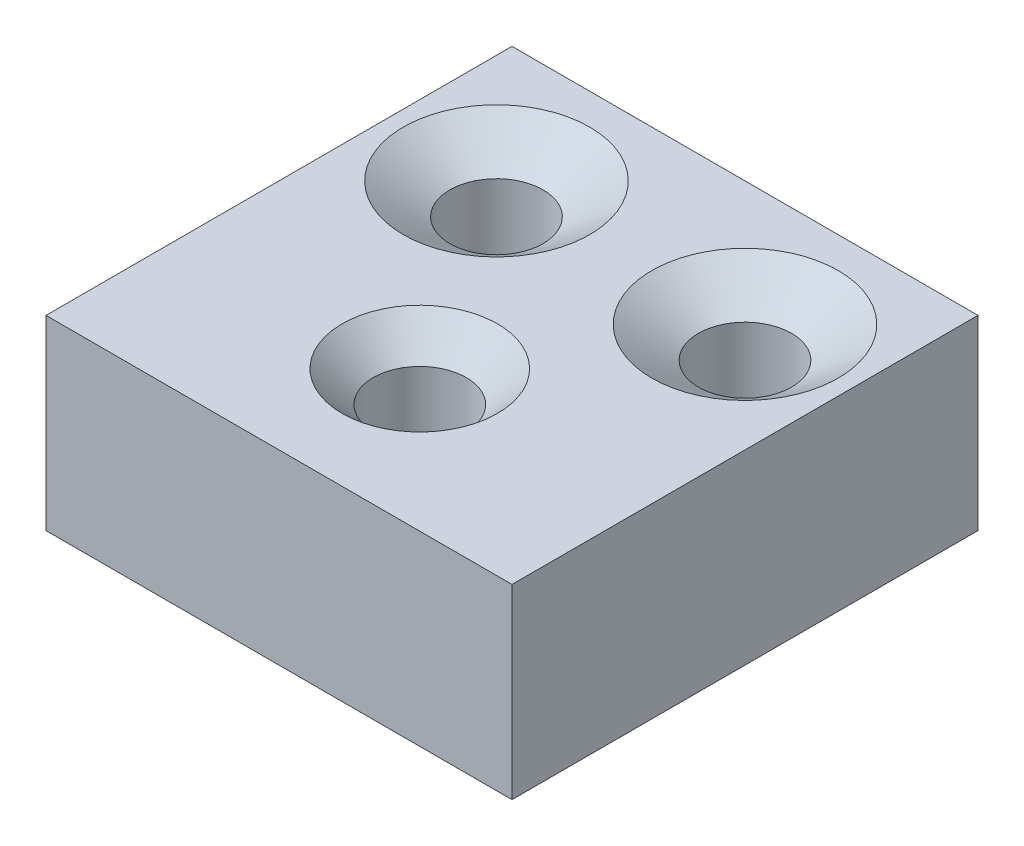
ISO-10303-21;
HEADER;
FILE_DESCRIPTION(('STEP AP214'),'2;1');
FILE_NAME('part.step','',(''),(''),'','','');
FILE_SCHEMA(('AUTOMOTIVE_DESIGN { 1 0 10303 214 1 1 1 1 }'));
ENDSEC;
DATA;
#1=APPLICATION_CONTEXT('core data for automotive mechanical design processes');
#2=APPLICATION_PROTOCOL_DEFINITION('international standard','automotive_design',2000,#1);
#3=PRODUCT_CONTEXT('',#1,'mechanical');
#4=PRODUCT('Part','Part','',(#3));
#5=PRODUCT_RELATED_PRODUCT_CATEGORY('part','',(#4));
#6=PRODUCT_DEFINITION_FORMATION('','',#4);
#7=PRODUCT_DEFINITION_CONTEXT('part definition',#1,'design');
#8=PRODUCT_DEFINITION('design','',#6,#7);
#9=PRODUCT_DEFINITION_SHAPE('','',#8);
#10=(LENGTH_UNIT() NAMED_UNIT(*) SI_UNIT(.MILLI.,.METRE.));
#11=(NAMED_UNIT(*) PLANE_ANGLE_UNIT() SI_UNIT($,.RADIAN.));
#12=(NAMED_UNIT(*) SI_UNIT($,.STERADIAN.) SOLID_ANGLE_UNIT());
#13=UNCERTAINTY_MEASURE_WITH_UNIT(LENGTH_MEASURE(1.E-05),#10,'distance_accuracy_value','');
#14=(GEOMETRIC_REPRESENTATION_CONTEXT(3) GLOBAL_UNCERTAINTY_ASSIGNED_CONTEXT((#13)) GLOBAL_UNIT_ASSIGNED_CONTEXT((#10,
#11,#12)) REPRESENTATION_CONTEXT('',''));
#15=CARTESIAN_POINT('',(0.,0.,0.));
#16=DIRECTION('',(0.,0.,1.));
#17=DIRECTION('',(1.,0.,0.));
#18=AXIS2_PLACEMENT_3D('',#15,#16,#17);
#19=CARTESIAN_POINT('',(75.,60.,40.));
#20=DIRECTION('',(-1.,0.,0.));
#21=DIRECTION('',(0.,0.,1.));
#22=AXIS2_PLACEMENT_3D('',#19,#20,#21);
#23=PLANE('',#22);
#24=DIRECTION('',(0.,0.,-1.));
#25=VECTOR('',#24,1.);
#26=CARTESIAN_POINT('',(75.,0.,40.));
#27=LINE('',#26,#25);
#28=CARTESIAN_POINT('',(75.,0.,110.));
#29=VERTEX_POINT('',#28);
#30=CARTESIAN_POINT('',(75.,0.,-40.));
#31=VERTEX_POINT('',#30);
#32=EDGE_CURVE('E87',#29,#31,#27,.T.);
#33=ORIENTED_EDGE('',*,*,#32,.T.);
#34=DIRECTION('',(0.,-1.,0.));
#35=VECTOR('',#34,1.);
#36=CARTESIAN_POINT('',(75.,60.,-40.));
#37=LINE('',#36,#35);
#38=CARTESIAN_POINT('',(75.,60.,-40.));
#39=VERTEX_POINT('',#38);
#40=EDGE_CURVE('E11',#39,#31,#37,.T.);
#41=ORIENTED_EDGE('',*,*,#40,.F.);
#42=DIRECTION('',(0.,0.,-1.));
#43=VECTOR('',#42,1.);
#44=CARTESIAN_POINT('',(75.,60.,40.));
#45=LINE('',#44,#43);
#46=CARTESIAN_POINT('',(75.,60.,110.));
#47=VERTEX_POINT('',#46);
#48=EDGE_CURVE('E81',#47,#39,#45,.T.);
#49=ORIENTED_EDGE('',*,*,#48,.F.);
#50=DIRECTION('',(0.,1.,0.));
#51=VECTOR('',#50,1.);
#52=CARTESIAN_POINT('',(75.,60.,110.));
#53=LINE('',#52,#51);
#54=EDGE_CURVE('E91',#29,#47,#53,.T.);
#55=ORIENTED_EDGE('',*,*,#54,.F.);
#56=EDGE_LOOP('',(#33,#41,#49,#55));
#57=FACE_BOUND('',#56,.T.);
#58=ADVANCED_FACE('F33',(#57),#23,.F.);
#59=CARTESIAN_POINT('',(-75.,60.,-40.));
#60=DIRECTION('',(0.,0.,1.));
#61=DIRECTION('',(1.,0.,0.));
#62=AXIS2_PLACEMENT_3D('',#59,#60,#61);
#63=PLANE('',#62);
#64=DIRECTION('',(-1.,0.,0.));
#65=VECTOR('',#64,1.);
#66=CARTESIAN_POINT('',(-75.,0.,-40.));
#67=LINE('',#66,#65);
#68=CARTESIAN_POINT('',(-75.,0.,-40.));
#69=VERTEX_POINT('',#68);
#70=EDGE_CURVE('E60',#31,#69,#67,.T.);
#71=ORIENTED_EDGE('',*,*,#70,.T.);
#72=DIRECTION('',(0.,-1.,0.));
#73=VECTOR('',#72,1.);
#74=CARTESIAN_POINT('',(-75.,60.,-40.));
#75=LINE('',#74,#73);
#76=CARTESIAN_POINT('',(-75.,60.,-40.));
#77=VERTEX_POINT('',#76);
#78=EDGE_CURVE('E41',#77,#69,#75,.T.);
#79=ORIENTED_EDGE('',*,*,#78,.F.);
#80=DIRECTION('',(-1.,0.,0.));
#81=VECTOR('',#80,1.);
#82=CARTESIAN_POINT('',(-75.,60.,-40.));
#83=LINE('',#82,#81);
#84=EDGE_CURVE('E49',#39,#77,#83,.T.);
#85=ORIENTED_EDGE('',*,*,#84,.F.);
#86=ORIENTED_EDGE('',*,*,#40,.T.);
#87=EDGE_LOOP('',(#71,#79,#85,#86));
#88=FACE_BOUND('',#87,.T.);
#89=ADVANCED_FACE('F127',(#88),#63,.F.);
#90=CARTESIAN_POINT('',(-75.,60.,40.));
#91=DIRECTION('',(1.,0.,0.));
#92=DIRECTION('',(0.,0.,-1.));
#93=AXIS2_PLACEMENT_3D('',#90,#91,#92);
#94=PLANE('',#93);
#95=DIRECTION('',(0.,0.,1.));
#96=VECTOR('',#95,1.);
#97=CARTESIAN_POINT('',(-75.,0.,40.));
#98=LINE('',#97,#96);
#99=CARTESIAN_POINT('',(-75.,0.,110.));
#100=VERTEX_POINT('',#99);
#101=EDGE_CURVE('E76',#69,#100,#98,.T.);
#102=ORIENTED_EDGE('',*,*,#101,.T.);
#103=DIRECTION('',(0.,-1.,0.));
#104=VECTOR('',#103,1.);
#105=CARTESIAN_POINT('',(-75.,60.,110.));
#106=LINE('',#105,#104);
#107=CARTESIAN_POINT('',(-75.,60.,110.));
#108=VERTEX_POINT('',#107);
#109=EDGE_CURVE('E80',#108,#100,#106,.T.);
#110=ORIENTED_EDGE('',*,*,#109,.F.);
#111=DIRECTION('',(0.,0.,1.));
#112=VECTOR('',#111,1.);
#113=CARTESIAN_POINT('',(-75.,60.,40.));
#114=LINE('',#113,#112);
#115=EDGE_CURVE('E64',#77,#108,#114,.T.);
#116=ORIENTED_EDGE('',*,*,#115,.F.);
#117=ORIENTED_EDGE('',*,*,#78,.T.);
#118=EDGE_LOOP('',(#102,#110,#116,#117));
#119=FACE_BOUND('',#118,.T.);
#120=ADVANCED_FACE('F78',(#119),#94,.F.);
#121=CARTESIAN_POINT('',(0.,60.,0.));
#122=DIRECTION('',(0.,-1.,0.));
#123=DIRECTION('',(0.,0.,-1.));
#124=AXIS2_PLACEMENT_3D('',#121,#122,#123);
#125=PLANE('',#124);
#126=CARTESIAN_POINT('',(0.,60.,64.6788910412876));
#127=DIRECTION('',(0.,1.,0.));
#128=DIRECTION('',(0.,0.,1.));
#129=AXIS2_PLACEMENT_3D('',#126,#127,#128);
#130=CIRCLE('',#129,25.);
#131=CARTESIAN_POINT('',(0.,60.,89.6788910412876));
#132=VERTEX_POINT('',#131);
#133=EDGE_CURVE('E266',#132,#132,#130,.T.);
#134=ORIENTED_EDGE('',*,*,#133,.F.);
#135=EDGE_LOOP('',(#134));
#136=FACE_BOUND('',#135,.T.);
#137=CARTESIAN_POINT('',(40.,60.,0.));
#138=DIRECTION('',(0.,1.,0.));
#139=DIRECTION('',(0.,0.,-1.));
#140=AXIS2_PLACEMENT_3D('',#137,#138,#139);
#141=CIRCLE('',#140,30.);
#142=CARTESIAN_POINT('',(40.,60.,-30.));
#143=VERTEX_POINT('',#142);
#144=EDGE_CURVE('E110',#143,#143,#141,.T.);
#145=ORIENTED_EDGE('',*,*,#144,.F.);
#146=EDGE_LOOP('',(#145));
#147=FACE_BOUND('',#146,.T.);
#148=CARTESIAN_POINT('',(-40.,60.,0.));
#149=DIRECTION('',(0.,-1.,0.));
#150=DIRECTION('',(0.,0.,-1.));
#151=AXIS2_PLACEMENT_3D('',#148,#149,#150);
#152=CIRCLE('',#151,30.);
#153=CARTESIAN_POINT('',(-40.,60.,-30.));
#154=VERTEX_POINT('',#153);
#155=EDGE_CURVE('E119',#154,#154,#152,.T.);
#156=ORIENTED_EDGE('',*,*,#155,.T.);
#157=EDGE_LOOP('',(#156));
#158=FACE_BOUND('',#157,.T.);
#159=ORIENTED_EDGE('',*,*,#48,.T.);
#160=ORIENTED_EDGE('',*,*,#84,.T.);
#161=ORIENTED_EDGE('',*,*,#115,.T.);
#162=DIRECTION('',(-1.,0.,0.));
#163=VECTOR('',#162,1.);
#164=CARTESIAN_POINT('',(-75.,60.,110.));
#165=LINE('',#164,#163);
#166=EDGE_CURVE('E94',#47,#108,#165,.T.);
#167=ORIENTED_EDGE('',*,*,#166,.F.);
#168=EDGE_LOOP('',(#159,#160,#161,#167));
#169=FACE_BOUND('',#168,.T.);
#170=ADVANCED_FACE('F130',(#136,#147,#158,#169),#125,.F.);
#171=CARTESIAN_POINT('',(0.,0.,0.));
#172=DIRECTION('',(0.,-1.,0.));
#173=DIRECTION('',(0.,0.,-1.));
#174=AXIS2_PLACEMENT_3D('',#171,#172,#173);
#175=PLANE('',#174);
#176=ORIENTED_EDGE('',*,*,#32,.F.);
#177=DIRECTION('',(1.,0.,0.));
#178=VECTOR('',#177,1.);
#179=CARTESIAN_POINT('',(-75.,0.,110.));
#180=LINE('',#179,#178);
#181=EDGE_CURVE('E84',#100,#29,#180,.T.);
#182=ORIENTED_EDGE('',*,*,#181,.F.);
#183=ORIENTED_EDGE('',*,*,#101,.F.);
#184=ORIENTED_EDGE('',*,*,#70,.F.);
#185=EDGE_LOOP('',(#176,#182,#183,#184));
#186=FACE_BOUND('',#185,.T.);
#187=ADVANCED_FACE('F85',(#186),#175,.T.);
#188=CARTESIAN_POINT('',(-40.,60.,0.));
#189=DIRECTION('',(0.,1.,0.));
#190=DIRECTION('',(0.,0.,1.));
#191=AXIS2_PLACEMENT_3D('',#188,#189,#190);
#192=CONICAL_SURFACE('',#191,30.,0.98279372324733);
#193=CARTESIAN_POINT('',(-40.,50.,0.));
#194=DIRECTION('',(0.,-1.,0.));
#195=DIRECTION('',(0.,0.,-1.));
#196=AXIS2_PLACEMENT_3D('',#193,#194,#195);
#197=CIRCLE('',#196,15.);
#198=CARTESIAN_POINT('',(-40.,50.,-15.));
#199=VERTEX_POINT('',#198);
#200=EDGE_CURVE('E116',#199,#199,#197,.T.);
#201=ORIENTED_EDGE('',*,*,#200,.T.);
#202=EDGE_LOOP('',(#201));
#203=FACE_BOUND('',#202,.T.);
#204=ORIENTED_EDGE('',*,*,#155,.F.);
#205=EDGE_LOOP('',(#204));
#206=FACE_BOUND('',#205,.T.);
#207=ADVANCED_FACE('F138',(#203,#206),#192,.F.);
#208=CARTESIAN_POINT('',(-40.,9.99999999999999,0.));
#209=DIRECTION('',(0.,-1.,0.));
#210=DIRECTION('',(0.,0.,-1.));
#211=AXIS2_PLACEMENT_3D('',#208,#209,#210);
#212=CYLINDRICAL_SURFACE('',#211,15.);
#213=CARTESIAN_POINT('',(-40.,9.99999999999999,0.));
#214=DIRECTION('',(0.,-1.,0.));
#215=DIRECTION('',(0.,0.,-1.));
#216=AXIS2_PLACEMENT_3D('',#213,#214,#215);
#217=CIRCLE('',#216,15.);
#218=CARTESIAN_POINT('',(-40.,9.99999999999999,-15.));
#219=VERTEX_POINT('',#218);
#220=EDGE_CURVE('E113',#219,#219,#217,.T.);
#221=ORIENTED_EDGE('',*,*,#220,.T.);
#222=EDGE_LOOP('',(#221));
#223=FACE_BOUND('',#222,.T.);
#224=ORIENTED_EDGE('',*,*,#200,.F.);
#225=EDGE_LOOP('',(#224));
#226=FACE_BOUND('',#225,.T.);
#227=ADVANCED_FACE('F157',(#223,#226),#212,.F.);
#228=CARTESIAN_POINT('',(-55.,9.99999999999999,0.));
#229=DIRECTION('',(0.,1.,0.));
#230=DIRECTION('',(0.,0.,1.));
#231=AXIS2_PLACEMENT_3D('',#228,#229,#230);
#232=PLANE('',#231);
#233=ORIENTED_EDGE('',*,*,#220,.F.);
#234=EDGE_LOOP('',(#233));
#235=FACE_BOUND('',#234,.T.);
#236=ADVANCED_FACE('F164',(#235),#232,.T.);
#237=CARTESIAN_POINT('',(40.,60.,0.));
#238=DIRECTION('',(0.,1.,0.));
#239=DIRECTION('',(0.,0.,1.));
#240=AXIS2_PLACEMENT_3D('',#237,#238,#239);
#241=CONICAL_SURFACE('',#240,30.,0.98279372324733);
#242=CARTESIAN_POINT('',(40.,50.,0.));
#243=DIRECTION('',(0.,1.,0.));
#244=DIRECTION('',(0.,0.,-1.));
#245=AXIS2_PLACEMENT_3D('',#242,#243,#244);
#246=CIRCLE('',#245,15.);
#247=CARTESIAN_POINT('',(40.,50.,-15.));
#248=VERTEX_POINT('',#247);
#249=EDGE_CURVE('E107',#248,#248,#246,.T.);
#250=ORIENTED_EDGE('',*,*,#249,.F.);
#251=EDGE_LOOP('',(#250));
#252=FACE_BOUND('',#251,.T.);
#253=ORIENTED_EDGE('',*,*,#144,.T.);
#254=EDGE_LOOP('',(#253));
#255=FACE_BOUND('',#254,.T.);
#256=ADVANCED_FACE('F172',(#252,#255),#241,.F.);
#257=CARTESIAN_POINT('',(40.,9.99999999999999,0.));
#258=DIRECTION('',(0.,-1.,0.));
#259=DIRECTION('',(0.,0.,-1.));
#260=AXIS2_PLACEMENT_3D('',#257,#258,#259);
#261=CYLINDRICAL_SURFACE('',#260,15.);
#262=CARTESIAN_POINT('',(40.,9.99999999999999,0.));
#263=DIRECTION('',(0.,1.,0.));
#264=DIRECTION('',(0.,0.,-1.));
#265=AXIS2_PLACEMENT_3D('',#262,#263,#264);
#266=CIRCLE('',#265,15.);
#267=CARTESIAN_POINT('',(40.,9.99999999999999,-15.));
#268=VERTEX_POINT('',#267);
#269=EDGE_CURVE('E104',#268,#268,#266,.T.);
#270=ORIENTED_EDGE('',*,*,#269,.F.);
#271=EDGE_LOOP('',(#270));
#272=FACE_BOUND('',#271,.T.);
#273=ORIENTED_EDGE('',*,*,#249,.T.);
#274=EDGE_LOOP('',(#273));
#275=FACE_BOUND('',#274,.T.);
#276=ADVANCED_FACE('F180',(#272,#275),#261,.F.);
#277=CARTESIAN_POINT('',(55.,9.99999999999999,0.));
#278=DIRECTION('',(0.,1.,0.));
#279=DIRECTION('',(0.,0.,1.));
#280=AXIS2_PLACEMENT_3D('',#277,#278,#279);
#281=PLANE('',#280);
#282=ORIENTED_EDGE('',*,*,#269,.T.);
#283=EDGE_LOOP('',(#282));
#284=FACE_BOUND('',#283,.T.);
#285=ADVANCED_FACE('F187',(#284),#281,.T.);
#286=CARTESIAN_POINT('',(0.,0.,110.));
#287=DIRECTION('',(0.,0.,1.));
#288=DIRECTION('',(1.,0.,0.));
#289=AXIS2_PLACEMENT_3D('',#286,#287,#288);
#290=PLANE('',#289);
#291=ORIENTED_EDGE('',*,*,#109,.T.);
#292=ORIENTED_EDGE('',*,*,#181,.T.);
#293=ORIENTED_EDGE('',*,*,#54,.T.);
#294=ORIENTED_EDGE('',*,*,#166,.T.);
#295=EDGE_LOOP('',(#291,#292,#293,#294));
#296=FACE_BOUND('',#295,.T.);
#297=ADVANCED_FACE('F93',(#296),#290,.T.);
#298=CARTESIAN_POINT('',(0.,9.99999999999999,64.6788910412876));
#299=DIRECTION('',(0.,-1.,0.));
#300=DIRECTION('',(0.,0.,-1.));
#301=AXIS2_PLACEMENT_3D('',#298,#299,#300);
#302=PLANE('',#301);
#303=CARTESIAN_POINT('',(0.,9.99999999999999,64.6788910412876));
#304=DIRECTION('',(0.,1.,0.));
#305=DIRECTION('',(0.,0.,1.));
#306=AXIS2_PLACEMENT_3D('',#303,#304,#305);
#307=CIRCLE('',#306,15.);
#308=CARTESIAN_POINT('',(0.,9.99999999999999,79.6788910412876));
#309=VERTEX_POINT('',#308);
#310=EDGE_CURVE('E95',#309,#309,#307,.T.);
#311=ORIENTED_EDGE('',*,*,#310,.T.);
#312=EDGE_LOOP('',(#311));
#313=FACE_BOUND('',#312,.T.);
#314=ADVANCED_FACE('F224',(#313),#302,.F.);
#315=CARTESIAN_POINT('',(0.,60.,64.6788910412876));
#316=DIRECTION('',(0.,1.,0.));
#317=DIRECTION('',(0.,0.,1.));
#318=AXIS2_PLACEMENT_3D('',#315,#316,#317);
#319=CYLINDRICAL_SURFACE('',#318,15.);
#320=ORIENTED_EDGE('',*,*,#310,.F.);
#321=EDGE_LOOP('',(#320));
#322=FACE_BOUND('',#321,.T.);
#323=CARTESIAN_POINT('',(0.,50.,64.6788910412876));
#324=DIRECTION('',(0.,1.,0.));
#325=DIRECTION('',(0.,0.,1.));
#326=AXIS2_PLACEMENT_3D('',#323,#324,#325);
#327=CIRCLE('',#326,15.);
#328=CARTESIAN_POINT('',(0.,50.,79.6788910412876));
#329=VERTEX_POINT('',#328);
#330=EDGE_CURVE('E98',#329,#329,#327,.T.);
#331=ORIENTED_EDGE('',*,*,#330,.T.);
#332=EDGE_LOOP('',(#331));
#333=FACE_BOUND('',#332,.T.);
#334=ADVANCED_FACE('F238',(#322,#333),#319,.F.);
#335=CARTESIAN_POINT('',(0.,60.,64.6788910412876));
#336=DIRECTION('',(0.,1.,0.));
#337=DIRECTION('',(0.,0.,1.));
#338=AXIS2_PLACEMENT_3D('',#335,#336,#337);
#339=CONICAL_SURFACE('',#338,25.,0.785398163397447);
#340=ORIENTED_EDGE('',*,*,#330,.F.);
#341=EDGE_LOOP('',(#340));
#342=FACE_BOUND('',#341,.T.);
#343=ORIENTED_EDGE('',*,*,#133,.T.);
#344=EDGE_LOOP('',(#343));
#345=FACE_BOUND('',#344,.T.);
#346=ADVANCED_FACE('F248',(#342,#345),#339,.F.);
#347=CLOSED_SHELL('',(#58,#89,#120,#170,#187,#207,#227,#236,#256,#276,#285,#297,#314,#334,#346));
#348=MANIFOLD_SOLID_BREP('B2',#347);
#349=ADVANCED_BREP_SHAPE_REPRESENTATION('',(#18,#348),#14);
#350=SHAPE_DEFINITION_REPRESENTATION(#9,#349);
ENDSEC;
END-ISO-10303-21;
